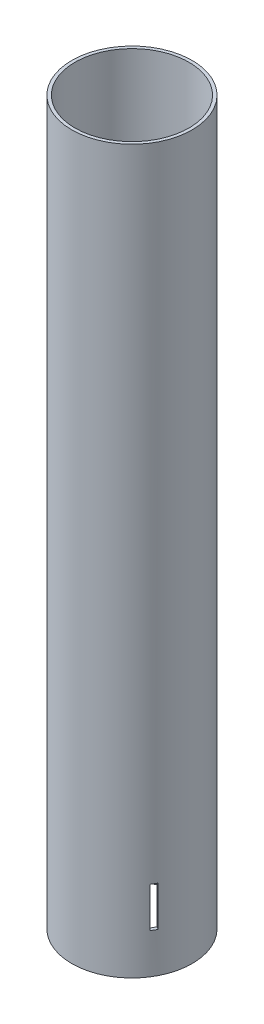
ISO-10303-21;
HEADER;
FILE_DESCRIPTION(('STEP AP214'),'2;1');
FILE_NAME('part.step','',(''),(''),'','','');
FILE_SCHEMA(('AUTOMOTIVE_DESIGN { 1 0 10303 214 1 1 1 1 }'));
ENDSEC;
DATA;
#1=APPLICATION_CONTEXT('core data for automotive mechanical design processes');
#2=APPLICATION_PROTOCOL_DEFINITION('international standard','automotive_design',2000,#1);
#3=PRODUCT_CONTEXT('',#1,'mechanical');
#4=PRODUCT('Part','Part','',(#3));
#5=PRODUCT_RELATED_PRODUCT_CATEGORY('part','',(#4));
#6=PRODUCT_DEFINITION_FORMATION('','',#4);
#7=PRODUCT_DEFINITION_CONTEXT('part definition',#1,'design');
#8=PRODUCT_DEFINITION('design','',#6,#7);
#9=PRODUCT_DEFINITION_SHAPE('','',#8);
#10=(LENGTH_UNIT() NAMED_UNIT(*) SI_UNIT(.MILLI.,.METRE.));
#11=(NAMED_UNIT(*) PLANE_ANGLE_UNIT() SI_UNIT($,.RADIAN.));
#12=(NAMED_UNIT(*) SI_UNIT($,.STERADIAN.) SOLID_ANGLE_UNIT());
#13=UNCERTAINTY_MEASURE_WITH_UNIT(LENGTH_MEASURE(1.E-05),#10,'distance_accuracy_value','');
#14=(GEOMETRIC_REPRESENTATION_CONTEXT(3) GLOBAL_UNCERTAINTY_ASSIGNED_CONTEXT((#13)) GLOBAL_UNIT_ASSIGNED_CONTEXT((#10,
#11,#12)) REPRESENTATION_CONTEXT('',''));
#15=CARTESIAN_POINT('',(0.,0.,0.));
#16=DIRECTION('',(0.,0.,1.));
#17=DIRECTION('',(1.,0.,0.));
#18=AXIS2_PLACEMENT_3D('',#15,#16,#17);
#19=CARTESIAN_POINT('',(0.,457.2,0.));
#20=DIRECTION('',(0.,1.,0.));
#21=DIRECTION('',(0.,0.,1.));
#22=AXIS2_PLACEMENT_3D('',#19,#20,#21);
#23=PLANE('',#22);
#24=CARTESIAN_POINT('',(0.,457.2,0.));
#25=DIRECTION('',(0.,1.,0.));
#26=DIRECTION('',(0.,0.,1.));
#27=AXIS2_PLACEMENT_3D('',#24,#25,#26);
#28=CIRCLE('',#27,38.1);
#29=CARTESIAN_POINT('',(0.,457.2,38.1));
#30=VERTEX_POINT('',#29);
#31=EDGE_CURVE('E186',#30,#30,#28,.T.);
#32=ORIENTED_EDGE('',*,*,#31,.T.);
#33=EDGE_LOOP('',(#32));
#34=FACE_BOUND('',#33,.T.);
#35=CARTESIAN_POINT('',(0.,457.2,0.));
#36=DIRECTION('',(0.,1.,0.));
#37=DIRECTION('',(0.,0.,1.));
#38=AXIS2_PLACEMENT_3D('',#35,#36,#37);
#39=CIRCLE('',#38,36.1);
#40=CARTESIAN_POINT('',(0.,457.2,36.1));
#41=VERTEX_POINT('',#40);
#42=EDGE_CURVE('E191',#41,#41,#39,.T.);
#43=ORIENTED_EDGE('',*,*,#42,.F.);
#44=EDGE_LOOP('',(#43));
#45=FACE_BOUND('',#44,.T.);
#46=ADVANCED_FACE('F38',(#34,#45),#23,.T.);
#47=CARTESIAN_POINT('',(0.,0.,0.));
#48=DIRECTION('',(0.,1.,0.));
#49=DIRECTION('',(0.,0.,1.));
#50=AXIS2_PLACEMENT_3D('',#47,#48,#49);
#51=PLANE('',#50);
#52=CARTESIAN_POINT('',(0.,0.,0.));
#53=DIRECTION('',(0.,1.,0.));
#54=DIRECTION('',(0.,0.,1.));
#55=AXIS2_PLACEMENT_3D('',#52,#53,#54);
#56=CIRCLE('',#55,38.1);
#57=CARTESIAN_POINT('',(0.,0.,38.1));
#58=VERTEX_POINT('',#57);
#59=EDGE_CURVE('E187',#58,#58,#56,.T.);
#60=ORIENTED_EDGE('',*,*,#59,.F.);
#61=EDGE_LOOP('',(#60));
#62=FACE_BOUND('',#61,.T.);
#63=CARTESIAN_POINT('',(0.,0.,0.));
#64=DIRECTION('',(0.,1.,0.));
#65=DIRECTION('',(0.,0.,1.));
#66=AXIS2_PLACEMENT_3D('',#63,#64,#65);
#67=CIRCLE('',#66,36.1);
#68=CARTESIAN_POINT('',(0.,0.,36.1));
#69=VERTEX_POINT('',#68);
#70=EDGE_CURVE('E195',#69,#69,#67,.T.);
#71=ORIENTED_EDGE('',*,*,#70,.T.);
#72=EDGE_LOOP('',(#71));
#73=FACE_BOUND('',#72,.T.);
#74=ADVANCED_FACE('F299',(#62,#73),#51,.F.);
#75=CARTESIAN_POINT('',(0.,457.2,0.));
#76=DIRECTION('',(0.,-1.,0.));
#77=DIRECTION('',(0.,0.,-1.));
#78=AXIS2_PLACEMENT_3D('',#75,#76,#77);
#79=CYLINDRICAL_SURFACE('',#78,38.1);
#80=CARTESIAN_POINT('',(0.,50.8,0.));
#81=DIRECTION('',(0.,1.,0.));
#82=DIRECTION('',(0.,0.,1.));
#83=AXIS2_PLACEMENT_3D('',#80,#81,#82);
#84=CIRCLE('',#83,38.1);
#85=CARTESIAN_POINT('',(-33.9067976142717,50.8,17.3763942043457));
#86=VERTEX_POINT('',#85);
#87=CARTESIAN_POINT('',(-32.0017976142717,50.8,20.6759509927644));
#88=VERTEX_POINT('',#87);
#89=EDGE_CURVE('E235',#86,#88,#84,.T.);
#90=ORIENTED_EDGE('',*,*,#89,.T.);
#91=DIRECTION('',(0.,-1.,0.));
#92=VECTOR('',#91,1.);
#93=CARTESIAN_POINT('',(-32.0017976142717,457.2,20.6759509927643));
#94=LINE('',#93,#92);
#95=CARTESIAN_POINT('',(-32.0017976142717,25.4,20.6759509927644));
#96=VERTEX_POINT('',#95);
#97=EDGE_CURVE('E221',#88,#96,#94,.T.);
#98=ORIENTED_EDGE('',*,*,#97,.T.);
#99=CARTESIAN_POINT('',(0.,25.4,0.));
#100=DIRECTION('',(0.,-1.,0.));
#101=DIRECTION('',(0.,0.,-1.));
#102=AXIS2_PLACEMENT_3D('',#99,#100,#101);
#103=CIRCLE('',#102,38.1);
#104=CARTESIAN_POINT('',(-33.9067976142717,25.4,17.3763942043456));
#105=VERTEX_POINT('',#104);
#106=EDGE_CURVE('E244',#96,#105,#103,.T.);
#107=ORIENTED_EDGE('',*,*,#106,.T.);
#108=DIRECTION('',(0.,-1.,0.));
#109=VECTOR('',#108,1.);
#110=CARTESIAN_POINT('',(-33.9067976142716,457.2,17.3763942043458));
#111=LINE('',#110,#109);
#112=EDGE_CURVE('E239',#105,#86,#111,.F.);
#113=ORIENTED_EDGE('',*,*,#112,.T.);
#114=EDGE_LOOP('',(#90,#98,#107,#113));
#115=FACE_BOUND('',#114,.T.);
#116=CARTESIAN_POINT('',(32.0017976142721,50.8000000000001,20.6759509927638));
#117=VERTEX_POINT('',#116);
#118=CARTESIAN_POINT('',(33.906797614272,50.8,17.3763942043452));
#119=VERTEX_POINT('',#118);
#120=EDGE_CURVE('E144',#117,#119,#84,.T.);
#121=ORIENTED_EDGE('',*,*,#120,.T.);
#122=DIRECTION('',(0.,-1.,0.));
#123=VECTOR('',#122,1.);
#124=CARTESIAN_POINT('',(33.9067976142719,457.2,17.3763942043453));
#125=LINE('',#124,#123);
#126=CARTESIAN_POINT('',(33.906797614272,25.4,17.3763942043452));
#127=VERTEX_POINT('',#126);
#128=EDGE_CURVE('E248',#119,#127,#125,.T.);
#129=ORIENTED_EDGE('',*,*,#128,.T.);
#130=CARTESIAN_POINT('',(32.001797614272,25.4,20.6759509927639));
#131=VERTEX_POINT('',#130);
#132=EDGE_CURVE('E243',#127,#131,#103,.T.);
#133=ORIENTED_EDGE('',*,*,#132,.T.);
#134=DIRECTION('',(0.,-1.,0.));
#135=VECTOR('',#134,1.);
#136=CARTESIAN_POINT('',(32.0017976142721,457.2,20.6759509927638));
#137=LINE('',#136,#135);
#138=EDGE_CURVE('E252',#131,#117,#137,.F.);
#139=ORIENTED_EDGE('',*,*,#138,.T.);
#140=EDGE_LOOP('',(#121,#129,#133,#139));
#141=FACE_BOUND('',#140,.T.);
#142=DIRECTION('',(0.,-1.,0.));
#143=VECTOR('',#142,1.);
#144=CARTESIAN_POINT('',(1.90499999999982,457.2,-38.0523451971097));
#145=LINE('',#144,#143);
#146=CARTESIAN_POINT('',(1.90500000000002,25.4,-38.0523451971097));
#147=VERTEX_POINT('',#146);
#148=CARTESIAN_POINT('',(1.90500000000001,50.8,-38.0523451971097));
#149=VERTEX_POINT('',#148);
#150=EDGE_CURVE('E209',#147,#149,#145,.F.);
#151=ORIENTED_EDGE('',*,*,#150,.T.);
#152=CARTESIAN_POINT('',(0.,50.8,0.));
#153=DIRECTION('',(0.,1.,0.));
#154=DIRECTION('',(0.,0.,1.));
#155=AXIS2_PLACEMENT_3D('',#152,#153,#154);
#156=CIRCLE('',#155,38.1);
#157=CARTESIAN_POINT('',(-1.90499999999997,50.8,-38.0523451971097));
#158=VERTEX_POINT('',#157);
#159=EDGE_CURVE('E206',#149,#158,#156,.T.);
#160=ORIENTED_EDGE('',*,*,#159,.T.);
#161=DIRECTION('',(0.,-1.,0.));
#162=VECTOR('',#161,1.);
#163=CARTESIAN_POINT('',(-1.90499999999993,457.2,-38.0523451971097));
#164=LINE('',#163,#162);
#165=CARTESIAN_POINT('',(-1.90499999999998,25.4,-38.0523451971097));
#166=VERTEX_POINT('',#165);
#167=EDGE_CURVE('E199',#158,#166,#164,.T.);
#168=ORIENTED_EDGE('',*,*,#167,.T.);
#169=CARTESIAN_POINT('',(0.,25.4,0.));
#170=DIRECTION('',(0.,-1.,0.));
#171=DIRECTION('',(0.,0.,-1.));
#172=AXIS2_PLACEMENT_3D('',#169,#170,#171);
#173=CIRCLE('',#172,38.1);
#174=EDGE_CURVE('E213',#166,#147,#173,.T.);
#175=ORIENTED_EDGE('',*,*,#174,.T.);
#176=EDGE_LOOP('',(#151,#160,#168,#175));
#177=FACE_BOUND('',#176,.T.);
#178=ORIENTED_EDGE('',*,*,#31,.F.);
#179=EDGE_LOOP('',(#178));
#180=FACE_BOUND('',#179,.T.);
#181=ORIENTED_EDGE('',*,*,#59,.T.);
#182=EDGE_LOOP('',(#181));
#183=FACE_BOUND('',#182,.T.);
#184=ADVANCED_FACE('F40',(#115,#141,#177,#180,#183),#79,.T.);
#185=CARTESIAN_POINT('',(0.,457.2,0.));
#186=DIRECTION('',(0.,-1.,0.));
#187=DIRECTION('',(0.,0.,-1.));
#188=AXIS2_PLACEMENT_3D('',#185,#186,#187);
#189=CYLINDRICAL_SURFACE('',#188,36.1);
#190=DIRECTION('',(0.,-1.,0.));
#191=VECTOR('',#190,1.);
#192=CARTESIAN_POINT('',(-30.2674572589393,457.2,19.6746291217467));
#193=LINE('',#192,#191);
#194=CARTESIAN_POINT('',(-30.2674572589393,50.8,19.6746291217467));
#195=VERTEX_POINT('',#194);
#196=CARTESIAN_POINT('',(-30.2674572589393,25.4,19.6746291217467));
#197=VERTEX_POINT('',#196);
#198=EDGE_CURVE('E11',#195,#197,#193,.T.);
#199=ORIENTED_EDGE('',*,*,#198,.F.);
#200=CARTESIAN_POINT('',(0.,50.8,0.));
#201=DIRECTION('',(0.,1.,0.));
#202=DIRECTION('',(0.,0.,1.));
#203=AXIS2_PLACEMENT_3D('',#200,#201,#202);
#204=CIRCLE('',#203,36.1);
#205=CARTESIAN_POINT('',(-32.1724572589393,50.8,16.375072333328));
#206=VERTEX_POINT('',#205);
#207=EDGE_CURVE('E47',#206,#195,#204,.T.);
#208=ORIENTED_EDGE('',*,*,#207,.F.);
#209=DIRECTION('',(0.,-1.,0.));
#210=VECTOR('',#209,1.);
#211=CARTESIAN_POINT('',(-32.1724572589392,457.2,16.3750723333282));
#212=LINE('',#211,#210);
#213=CARTESIAN_POINT('',(-32.1724572589393,25.4,16.375072333328));
#214=VERTEX_POINT('',#213);
#215=EDGE_CURVE('E161',#214,#206,#212,.F.);
#216=ORIENTED_EDGE('',*,*,#215,.F.);
#217=CARTESIAN_POINT('',(0.,25.4,0.));
#218=DIRECTION('',(0.,-1.,0.));
#219=DIRECTION('',(0.,0.,-1.));
#220=AXIS2_PLACEMENT_3D('',#217,#218,#219);
#221=CIRCLE('',#220,36.1);
#222=EDGE_CURVE('E157',#197,#214,#221,.T.);
#223=ORIENTED_EDGE('',*,*,#222,.F.);
#224=EDGE_LOOP('',(#199,#208,#216,#223));
#225=FACE_BOUND('',#224,.T.);
#226=DIRECTION('',(0.,-1.,0.));
#227=VECTOR('',#226,1.);
#228=CARTESIAN_POINT('',(32.1724572589395,457.2,16.3750723333277));
#229=LINE('',#228,#227);
#230=CARTESIAN_POINT('',(32.1724572589395,50.8,16.3750723333276));
#231=VERTEX_POINT('',#230);
#232=CARTESIAN_POINT('',(32.1724572589395,25.4,16.3750723333276));
#233=VERTEX_POINT('',#232);
#234=EDGE_CURVE('E152',#231,#233,#229,.T.);
#235=ORIENTED_EDGE('',*,*,#234,.F.);
#236=CARTESIAN_POINT('',(30.2674572589395,50.8,19.6746291217463));
#237=VERTEX_POINT('',#236);
#238=EDGE_CURVE('E141',#237,#231,#204,.T.);
#239=ORIENTED_EDGE('',*,*,#238,.F.);
#240=DIRECTION('',(0.,-1.,0.));
#241=VECTOR('',#240,1.);
#242=CARTESIAN_POINT('',(30.2674572589396,457.2,19.6746291217462));
#243=LINE('',#242,#241);
#244=CARTESIAN_POINT('',(30.2674572589396,25.4,19.6746291217462));
#245=VERTEX_POINT('',#244);
#246=EDGE_CURVE('E126',#245,#237,#243,.F.);
#247=ORIENTED_EDGE('',*,*,#246,.F.);
#248=EDGE_CURVE('E135',#233,#245,#221,.T.);
#249=ORIENTED_EDGE('',*,*,#248,.F.);
#250=EDGE_LOOP('',(#235,#239,#247,#249));
#251=FACE_BOUND('',#250,.T.);
#252=DIRECTION('',(0.,-1.,0.));
#253=VECTOR('',#252,1.);
#254=CARTESIAN_POINT('',(-1.90499999999993,457.2,-36.0497014550745));
#255=LINE('',#254,#253);
#256=CARTESIAN_POINT('',(-1.90499999999997,50.8,-36.0497014550745));
#257=VERTEX_POINT('',#256);
#258=CARTESIAN_POINT('',(-1.90499999999998,25.4,-36.0497014550745));
#259=VERTEX_POINT('',#258);
#260=EDGE_CURVE('E136',#257,#259,#255,.T.);
#261=ORIENTED_EDGE('',*,*,#260,.F.);
#262=CARTESIAN_POINT('',(0.,50.8,0.));
#263=DIRECTION('',(0.,1.,0.));
#264=DIRECTION('',(0.,0.,1.));
#265=AXIS2_PLACEMENT_3D('',#262,#263,#264);
#266=CIRCLE('',#265,36.1);
#267=CARTESIAN_POINT('',(1.90500000000001,50.8,-36.0497014550745));
#268=VERTEX_POINT('',#267);
#269=EDGE_CURVE('E177',#268,#257,#266,.T.);
#270=ORIENTED_EDGE('',*,*,#269,.F.);
#271=DIRECTION('',(0.,-1.,0.));
#272=VECTOR('',#271,1.);
#273=CARTESIAN_POINT('',(1.90499999999982,457.2,-36.0497014550745));
#274=LINE('',#273,#272);
#275=CARTESIAN_POINT('',(1.90500000000002,25.4,-36.0497014550745));
#276=VERTEX_POINT('',#275);
#277=EDGE_CURVE('E180',#276,#268,#274,.F.);
#278=ORIENTED_EDGE('',*,*,#277,.F.);
#279=CARTESIAN_POINT('',(0.,25.4,0.));
#280=DIRECTION('',(0.,-1.,0.));
#281=DIRECTION('',(0.,0.,-1.));
#282=AXIS2_PLACEMENT_3D('',#279,#280,#281);
#283=CIRCLE('',#282,36.1);
#284=EDGE_CURVE('E183',#259,#276,#283,.T.);
#285=ORIENTED_EDGE('',*,*,#284,.F.);
#286=EDGE_LOOP('',(#261,#270,#278,#285));
#287=FACE_BOUND('',#286,.T.);
#288=ORIENTED_EDGE('',*,*,#42,.T.);
#289=EDGE_LOOP('',(#288));
#290=FACE_BOUND('',#289,.T.);
#291=ORIENTED_EDGE('',*,*,#70,.F.);
#292=EDGE_LOOP('',(#291));
#293=FACE_BOUND('',#292,.T.);
#294=ADVANCED_FACE('F150',(#225,#251,#287,#290,#293),#189,.F.);
#295=CARTESIAN_POINT('',(-1.90499999999997,50.8,-38.1));
#296=DIRECTION('',(-1.,0.,0.));
#297=DIRECTION('',(0.,-1.,0.));
#298=AXIS2_PLACEMENT_3D('',#295,#296,#297);
#299=PLANE('',#298);
#300=DIRECTION('',(0.,0.,1.));
#301=VECTOR('',#300,1.);
#302=CARTESIAN_POINT('',(-1.90499999999997,50.8,-38.1));
#303=LINE('',#302,#301);
#304=EDGE_CURVE('E216',#158,#257,#303,.T.);
#305=ORIENTED_EDGE('',*,*,#304,.T.);
#306=ORIENTED_EDGE('',*,*,#260,.T.);
#307=DIRECTION('',(0.,0.,1.));
#308=VECTOR('',#307,1.);
#309=CARTESIAN_POINT('',(-1.90499999999998,25.4,-38.1));
#310=LINE('',#309,#308);
#311=EDGE_CURVE('E217',#166,#259,#310,.T.);
#312=ORIENTED_EDGE('',*,*,#311,.F.);
#313=ORIENTED_EDGE('',*,*,#167,.F.);
#314=EDGE_LOOP('',(#305,#306,#312,#313));
#315=FACE_BOUND('',#314,.T.);
#316=ADVANCED_FACE('F310',(#315),#299,.F.);
#317=CARTESIAN_POINT('',(-1.90499999999997,50.8,-38.1));
#318=DIRECTION('',(0.,1.,0.));
#319=DIRECTION('',(0.,0.,1.));
#320=AXIS2_PLACEMENT_3D('',#317,#318,#319);
#321=PLANE('',#320);
#322=DIRECTION('',(0.,0.,1.));
#323=VECTOR('',#322,1.);
#324=CARTESIAN_POINT('',(1.90500000000001,50.8,-38.1));
#325=LINE('',#324,#323);
#326=EDGE_CURVE('E225',#149,#268,#325,.T.);
#327=ORIENTED_EDGE('',*,*,#326,.T.);
#328=ORIENTED_EDGE('',*,*,#269,.T.);
#329=ORIENTED_EDGE('',*,*,#304,.F.);
#330=ORIENTED_EDGE('',*,*,#159,.F.);
#331=EDGE_LOOP('',(#327,#328,#329,#330));
#332=FACE_BOUND('',#331,.T.);
#333=ADVANCED_FACE('F314',(#332),#321,.F.);
#334=CARTESIAN_POINT('',(1.90500000000001,50.8,-38.1));
#335=DIRECTION('',(1.,0.,0.));
#336=DIRECTION('',(0.,1.,0.));
#337=AXIS2_PLACEMENT_3D('',#334,#335,#336);
#338=PLANE('',#337);
#339=DIRECTION('',(0.,0.,1.));
#340=VECTOR('',#339,1.);
#341=CARTESIAN_POINT('',(1.90500000000002,25.4,-38.1));
#342=LINE('',#341,#340);
#343=EDGE_CURVE('E220',#147,#276,#342,.T.);
#344=ORIENTED_EDGE('',*,*,#343,.T.);
#345=ORIENTED_EDGE('',*,*,#277,.T.);
#346=ORIENTED_EDGE('',*,*,#326,.F.);
#347=ORIENTED_EDGE('',*,*,#150,.F.);
#348=EDGE_LOOP('',(#344,#345,#346,#347));
#349=FACE_BOUND('',#348,.T.);
#350=ADVANCED_FACE('F319',(#349),#338,.F.);
#351=CARTESIAN_POINT('',(-1.90499999999998,25.4,-38.1));
#352=DIRECTION('',(0.,-1.,0.));
#353=DIRECTION('',(0.,0.,-1.));
#354=AXIS2_PLACEMENT_3D('',#351,#352,#353);
#355=PLANE('',#354);
#356=ORIENTED_EDGE('',*,*,#174,.F.);
#357=ORIENTED_EDGE('',*,*,#311,.T.);
#358=ORIENTED_EDGE('',*,*,#284,.T.);
#359=ORIENTED_EDGE('',*,*,#343,.F.);
#360=EDGE_LOOP('',(#356,#357,#358,#359));
#361=FACE_BOUND('',#360,.T.);
#362=ADVANCED_FACE('F316',(#361),#355,.F.);
#363=CARTESIAN_POINT('',(44.1202839420937,50.8,27.6725623363024));
#364=DIRECTION('',(-0.499999999999992,0.,0.866025403784443));
#365=DIRECTION('',(0.866025403784443,0.,0.499999999999992));
#366=AXIS2_PLACEMENT_3D('',#363,#364,#365);
#367=PLANE('',#366);
#368=DIRECTION('',(-0.866025403784443,0.,-0.499999999999992));
#369=VECTOR('',#368,1.);
#370=CARTESIAN_POINT('',(44.1202839420937,25.4,27.6725623363025));
#371=LINE('',#370,#369);
#372=EDGE_CURVE('E129',#131,#245,#371,.T.);
#373=ORIENTED_EDGE('',*,*,#372,.T.);
#374=ORIENTED_EDGE('',*,*,#246,.T.);
#375=DIRECTION('',(-0.866025403784443,0.,-0.499999999999992));
#376=VECTOR('',#375,1.);
#377=CARTESIAN_POINT('',(44.1202839420937,50.8,27.6725623363024));
#378=LINE('',#377,#376);
#379=EDGE_CURVE('E62',#117,#237,#378,.T.);
#380=ORIENTED_EDGE('',*,*,#379,.F.);
#381=ORIENTED_EDGE('',*,*,#138,.F.);
#382=EDGE_LOOP('',(#373,#374,#380,#381));
#383=FACE_BOUND('',#382,.T.);
#384=ADVANCED_FACE('F127',(#383),#367,.F.);
#385=CARTESIAN_POINT('',(46.0252839420937,50.8,24.3730055478837));
#386=DIRECTION('',(0.499999999999992,0.,-0.866025403784443));
#387=DIRECTION('',(-0.866025403784443,0.,-0.499999999999992));
#388=AXIS2_PLACEMENT_3D('',#385,#386,#387);
#389=PLANE('',#388);
#390=DIRECTION('',(-0.866025403784443,0.,-0.499999999999992));
#391=VECTOR('',#390,1.);
#392=CARTESIAN_POINT('',(46.0252839420937,50.8,24.3730055478837));
#393=LINE('',#392,#391);
#394=EDGE_CURVE('E147',#119,#231,#393,.T.);
#395=ORIENTED_EDGE('',*,*,#394,.T.);
#396=ORIENTED_EDGE('',*,*,#234,.T.);
#397=DIRECTION('',(-0.866025403784443,0.,-0.499999999999992));
#398=VECTOR('',#397,1.);
#399=CARTESIAN_POINT('',(46.0252839420937,25.4,24.3730055478837));
#400=LINE('',#399,#398);
#401=EDGE_CURVE('E266',#127,#233,#400,.T.);
#402=ORIENTED_EDGE('',*,*,#401,.F.);
#403=ORIENTED_EDGE('',*,*,#128,.F.);
#404=EDGE_LOOP('',(#395,#396,#402,#403));
#405=FACE_BOUND('',#404,.T.);
#406=ADVANCED_FACE('F274',(#405),#389,.F.);
#407=CARTESIAN_POINT('',(-44.1202839420935,25.4,27.6725623363031));
#408=DIRECTION('',(0.,-1.,0.));
#409=DIRECTION('',(0.,0.,-1.));
#410=AXIS2_PLACEMENT_3D('',#407,#408,#409);
#411=PLANE('',#410);
#412=ORIENTED_EDGE('',*,*,#401,.T.);
#413=ORIENTED_EDGE('',*,*,#248,.T.);
#414=ORIENTED_EDGE('',*,*,#372,.F.);
#415=ORIENTED_EDGE('',*,*,#132,.F.);
#416=EDGE_LOOP('',(#412,#413,#414,#415));
#417=FACE_BOUND('',#416,.T.);
#418=ADVANCED_FACE('F282',(#417),#411,.F.);
#419=CARTESIAN_POINT('',(-44.1202839420935,50.8,27.6725623363031));
#420=DIRECTION('',(0.,1.,0.));
#421=DIRECTION('',(0.,0.,1.));
#422=AXIS2_PLACEMENT_3D('',#419,#420,#421);
#423=PLANE('',#422);
#424=ORIENTED_EDGE('',*,*,#379,.T.);
#425=ORIENTED_EDGE('',*,*,#238,.T.);
#426=ORIENTED_EDGE('',*,*,#394,.F.);
#427=ORIENTED_EDGE('',*,*,#120,.F.);
#428=EDGE_LOOP('',(#424,#425,#426,#427));
#429=FACE_BOUND('',#428,.T.);
#430=ADVANCED_FACE('F139',(#429),#423,.F.);
#431=CARTESIAN_POINT('',(-44.1202839420935,50.8,27.6725623363031));
#432=DIRECTION('',(0.500000000000004,0.,0.866025403784436));
#433=DIRECTION('',(0.866025403784436,0.,-0.500000000000004));
#434=AXIS2_PLACEMENT_3D('',#431,#432,#433);
#435=PLANE('',#434);
#436=DIRECTION('',(0.866025403784436,0.,-0.500000000000004));
#437=VECTOR('',#436,1.);
#438=CARTESIAN_POINT('',(-44.1202839420935,50.8,27.6725623363031));
#439=LINE('',#438,#437);
#440=EDGE_CURVE('E255',#88,#195,#439,.T.);
#441=ORIENTED_EDGE('',*,*,#440,.T.);
#442=ORIENTED_EDGE('',*,*,#198,.T.);
#443=DIRECTION('',(0.866025403784436,0.,-0.500000000000004));
#444=VECTOR('',#443,1.);
#445=CARTESIAN_POINT('',(-44.1202839420935,25.4,27.6725623363031));
#446=LINE('',#445,#444);
#447=EDGE_CURVE('E256',#96,#197,#446,.T.);
#448=ORIENTED_EDGE('',*,*,#447,.F.);
#449=ORIENTED_EDGE('',*,*,#97,.F.);
#450=EDGE_LOOP('',(#441,#442,#448,#449));
#451=FACE_BOUND('',#450,.T.);
#452=ADVANCED_FACE('F290',(#451),#435,.F.);
#453=DIRECTION('',(0.866025403784436,0.,-0.500000000000004));
#454=VECTOR('',#453,1.);
#455=CARTESIAN_POINT('',(-46.0252839420935,50.8,24.3730055478844));
#456=LINE('',#455,#454);
#457=EDGE_CURVE('E261',#86,#206,#456,.T.);
#458=ORIENTED_EDGE('',*,*,#457,.T.);
#459=ORIENTED_EDGE('',*,*,#207,.T.);
#460=ORIENTED_EDGE('',*,*,#440,.F.);
#461=ORIENTED_EDGE('',*,*,#89,.F.);
#462=EDGE_LOOP('',(#458,#459,#460,#461));
#463=FACE_BOUND('',#462,.T.);
#464=ADVANCED_FACE('F292',(#463),#423,.F.);
#465=CARTESIAN_POINT('',(-46.0252839420935,50.8,24.3730055478844));
#466=DIRECTION('',(-0.500000000000004,0.,-0.866025403784436));
#467=DIRECTION('',(-0.866025403784436,0.,0.500000000000004));
#468=AXIS2_PLACEMENT_3D('',#465,#466,#467);
#469=PLANE('',#468);
#470=DIRECTION('',(0.866025403784436,0.,-0.500000000000004));
#471=VECTOR('',#470,1.);
#472=CARTESIAN_POINT('',(-46.0252839420935,25.4,24.3730055478844));
#473=LINE('',#472,#471);
#474=EDGE_CURVE('E54',#105,#214,#473,.T.);
#475=ORIENTED_EDGE('',*,*,#474,.T.);
#476=ORIENTED_EDGE('',*,*,#215,.T.);
#477=ORIENTED_EDGE('',*,*,#457,.F.);
#478=ORIENTED_EDGE('',*,*,#112,.F.);
#479=EDGE_LOOP('',(#475,#476,#477,#478));
#480=FACE_BOUND('',#479,.T.);
#481=ADVANCED_FACE('F297',(#480),#469,.F.);
#482=ORIENTED_EDGE('',*,*,#447,.T.);
#483=ORIENTED_EDGE('',*,*,#222,.T.);
#484=ORIENTED_EDGE('',*,*,#474,.F.);
#485=ORIENTED_EDGE('',*,*,#106,.F.);
#486=EDGE_LOOP('',(#482,#483,#484,#485));
#487=FACE_BOUND('',#486,.T.);
#488=ADVANCED_FACE('F285',(#487),#411,.F.);
#489=CLOSED_SHELL('',(#46,#74,#184,#294,#316,#333,#350,#362,#384,#406,#418,#430,#452,#464,#481,#488));
#490=MANIFOLD_SOLID_BREP('B2',#489);
#491=ADVANCED_BREP_SHAPE_REPRESENTATION('',(#18,#490),#14);
#492=SHAPE_DEFINITION_REPRESENTATION(#9,#491);
ENDSEC;
END-ISO-10303-21;
